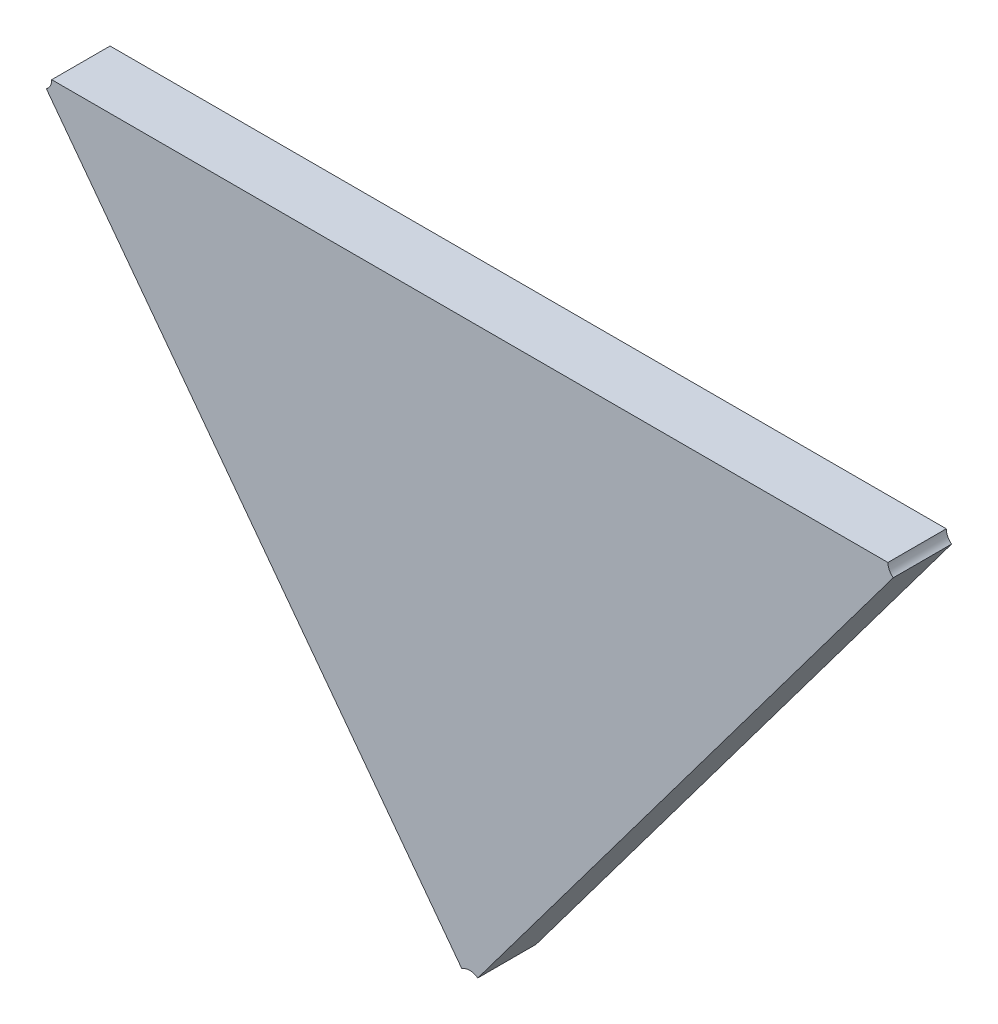
ISO-10303-21;
HEADER;
FILE_DESCRIPTION(('STEP AP214'),'2;1');
FILE_NAME('part.step','',(''),(''),'','','');
FILE_SCHEMA(('AUTOMOTIVE_DESIGN { 1 0 10303 214 1 1 1 1 }'));
ENDSEC;
DATA;
#1=APPLICATION_CONTEXT('core data for automotive mechanical design processes');
#2=APPLICATION_PROTOCOL_DEFINITION('international standard','automotive_design',2000,#1);
#3=PRODUCT_CONTEXT('',#1,'mechanical');
#4=PRODUCT('Part','Part','',(#3));
#5=PRODUCT_RELATED_PRODUCT_CATEGORY('part','',(#4));
#6=PRODUCT_DEFINITION_FORMATION('','',#4);
#7=PRODUCT_DEFINITION_CONTEXT('part definition',#1,'design');
#8=PRODUCT_DEFINITION('design','',#6,#7);
#9=PRODUCT_DEFINITION_SHAPE('','',#8);
#10=(LENGTH_UNIT() NAMED_UNIT(*) SI_UNIT(.MILLI.,.METRE.));
#11=(NAMED_UNIT(*) PLANE_ANGLE_UNIT() SI_UNIT($,.RADIAN.));
#12=(NAMED_UNIT(*) SI_UNIT($,.STERADIAN.) SOLID_ANGLE_UNIT());
#13=UNCERTAINTY_MEASURE_WITH_UNIT(LENGTH_MEASURE(1.E-05),#10,'distance_accuracy_value','');
#14=(GEOMETRIC_REPRESENTATION_CONTEXT(3) GLOBAL_UNCERTAINTY_ASSIGNED_CONTEXT((#13)) GLOBAL_UNIT_ASSIGNED_CONTEXT((#10,
#11,#12)) REPRESENTATION_CONTEXT('',''));
#15=CARTESIAN_POINT('',(0.,0.,0.));
#16=DIRECTION('',(0.,0.,1.));
#17=DIRECTION('',(1.,0.,0.));
#18=AXIS2_PLACEMENT_3D('',#15,#16,#17);
#19=CARTESIAN_POINT('',(-1.3307444469272,-1.3377475393434,0.00415));
#20=DIRECTION('',(0.,0.,1.));
#21=DIRECTION('',(1.,0.,0.));
#22=AXIS2_PLACEMENT_3D('',#19,#20,#21);
#23=PLANE('',#22);
#24=CARTESIAN_POINT('',(-1.3551454031113,-1.327552967697,0.00415));
#25=DIRECTION('',(0.,0.,-1.));
#26=DIRECTION('',(-0.599726822848916,0.800204810005254,0.));
#27=AXIS2_PLACEMENT_3D('',#24,#25,#26);
#28=CIRCLE('',#27,0.000749999999999995);
#29=CARTESIAN_POINT('',(-1.3543954031112,-1.327552967697,0.00415));
#30=VERTEX_POINT('',#29);
#31=CARTESIAN_POINT('',(-1.3546956079941,-1.3281531213045,0.00415));
#32=VERTEX_POINT('',#31);
#33=EDGE_CURVE('E11',#30,#32,#28,.T.);
#34=ORIENTED_EDGE('',*,*,#33,.T.);
#35=DIRECTION('',(0.599726822848935,-0.80020481000524,0.));
#36=VECTOR('',#35,1.);
#37=CARTESIAN_POINT('',(-1.3546956079941,-1.3281531213045,0.00415));
#38=LINE('',#37,#36);
#39=CARTESIAN_POINT('',(-1.3311942420443,-1.3595105749955,0.00415));
#40=VERTEX_POINT('',#39);
#41=EDGE_CURVE('E24',#32,#40,#38,.T.);
#42=ORIENTED_EDGE('',*,*,#41,.T.);
#43=CARTESIAN_POINT('',(-1.3307444469272,-1.360110728603,0.00415));
#44=DIRECTION('',(0.,0.,-1.));
#45=DIRECTION('',(-0.599726822848917,-0.800204810005254,0.));
#46=AXIS2_PLACEMENT_3D('',#43,#44,#45);
#47=CIRCLE('',#46,0.000750000000000013);
#48=CARTESIAN_POINT('',(-1.33029465181,-1.3595105749955,0.00415));
#49=VERTEX_POINT('',#48);
#50=EDGE_CURVE('E87',#40,#49,#47,.T.);
#51=ORIENTED_EDGE('',*,*,#50,.T.);
#52=DIRECTION('',(0.599726822848935,0.80020481000524,0.));
#53=VECTOR('',#52,1.);
#54=CARTESIAN_POINT('',(-1.33029465181,-1.3595105749955,0.00415));
#55=LINE('',#54,#53);
#56=CARTESIAN_POINT('',(-1.3067932858602,-1.3281531213045,0.00415));
#57=VERTEX_POINT('',#56);
#58=EDGE_CURVE('E112',#49,#57,#55,.T.);
#59=ORIENTED_EDGE('',*,*,#58,.T.);
#60=CARTESIAN_POINT('',(-1.3063434907431,-1.327552967697,0.00415));
#61=DIRECTION('',(0.,0.,-1.));
#62=DIRECTION('',(1.,0.,0.));
#63=AXIS2_PLACEMENT_3D('',#60,#61,#62);
#64=CIRCLE('',#63,0.000750000000000008);
#65=CARTESIAN_POINT('',(-1.3070934907431,-1.327552967697,0.00415));
#66=VERTEX_POINT('',#65);
#67=EDGE_CURVE('E110',#57,#66,#64,.T.);
#68=ORIENTED_EDGE('',*,*,#67,.T.);
#69=DIRECTION('',(-1.,0.,0.));
#70=VECTOR('',#69,1.);
#71=CARTESIAN_POINT('',(-1.3070934907431,-1.327552967697,0.00415));
#72=LINE('',#71,#70);
#73=EDGE_CURVE('E108',#66,#30,#72,.T.);
#74=ORIENTED_EDGE('',*,*,#73,.T.);
#75=EDGE_LOOP('',(#34,#42,#51,#59,#68,#74));
#76=FACE_BOUND('',#75,.T.);
#77=ADVANCED_FACE('F17',(#76),#23,.T.);
#78=CARTESIAN_POINT('',(-1.3063434907431,-1.327552967697,0.00085));
#79=DIRECTION('',(0.,1.,0.));
#80=DIRECTION('',(-1.,0.,0.));
#81=AXIS2_PLACEMENT_3D('',#78,#79,#80);
#82=PLANE('',#81);
#83=DIRECTION('',(0.,0.,1.));
#84=VECTOR('',#83,1.);
#85=CARTESIAN_POINT('',(-1.3543954031112,-1.327552967697,0.00115));
#86=LINE('',#85,#84);
#87=CARTESIAN_POINT('',(-1.3543954031112,-1.327552967697,0.00085));
#88=VERTEX_POINT('',#87);
#89=EDGE_CURVE('E105',#88,#30,#86,.T.);
#90=ORIENTED_EDGE('',*,*,#89,.T.);
#91=ORIENTED_EDGE('',*,*,#73,.F.);
#92=DIRECTION('',(0.,0.,-1.));
#93=VECTOR('',#92,1.);
#94=CARTESIAN_POINT('',(-1.3070934907431,-1.327552967697,0.00115));
#95=LINE('',#94,#93);
#96=CARTESIAN_POINT('',(-1.3070934907431,-1.327552967697,0.00085));
#97=VERTEX_POINT('',#96);
#98=EDGE_CURVE('E103',#66,#97,#95,.T.);
#99=ORIENTED_EDGE('',*,*,#98,.T.);
#100=DIRECTION('',(-1.,0.,0.));
#101=VECTOR('',#100,1.);
#102=CARTESIAN_POINT('',(-1.3063434907431,-1.327552967697,0.00085));
#103=LINE('',#102,#101);
#104=EDGE_CURVE('E100',#97,#88,#103,.T.);
#105=ORIENTED_EDGE('',*,*,#104,.T.);
#106=EDGE_LOOP('',(#90,#91,#99,#105));
#107=FACE_BOUND('',#106,.T.);
#108=ADVANCED_FACE('F127',(#107),#82,.T.);
#109=CARTESIAN_POINT('',(-1.3307444469272,-1.360110728603,0.00085));
#110=DIRECTION('',(0.800204810005241,-0.599726822848934,0.));
#111=DIRECTION('',(0.599726822848934,0.800204810005241,0.));
#112=AXIS2_PLACEMENT_3D('',#109,#110,#111);
#113=PLANE('',#112);
#114=DIRECTION('',(0.,0.,-1.));
#115=VECTOR('',#114,1.);
#116=CARTESIAN_POINT('',(-1.33029465181,-1.3595105749955,0.00115));
#117=LINE('',#116,#115);
#118=CARTESIAN_POINT('',(-1.33029465181,-1.3595105749955,0.00085));
#119=VERTEX_POINT('',#118);
#120=EDGE_CURVE('E98',#49,#119,#117,.T.);
#121=ORIENTED_EDGE('',*,*,#120,.T.);
#122=DIRECTION('',(0.599726822848934,0.800204810005241,0.));
#123=VECTOR('',#122,1.);
#124=CARTESIAN_POINT('',(-1.3307444469272,-1.360110728603,0.00085));
#125=LINE('',#124,#123);
#126=CARTESIAN_POINT('',(-1.3067932858602,-1.3281531213045,0.00085));
#127=VERTEX_POINT('',#126);
#128=EDGE_CURVE('E73',#119,#127,#125,.T.);
#129=ORIENTED_EDGE('',*,*,#128,.T.);
#130=DIRECTION('',(0.,0.,1.));
#131=VECTOR('',#130,1.);
#132=CARTESIAN_POINT('',(-1.3067932858602,-1.3281531213045,0.00115));
#133=LINE('',#132,#131);
#134=EDGE_CURVE('E94',#127,#57,#133,.T.);
#135=ORIENTED_EDGE('',*,*,#134,.T.);
#136=ORIENTED_EDGE('',*,*,#58,.F.);
#137=EDGE_LOOP('',(#121,#129,#135,#136));
#138=FACE_BOUND('',#137,.T.);
#139=ADVANCED_FACE('F125',(#138),#113,.T.);
#140=CARTESIAN_POINT('',(-1.322611951906,-1.3397638650791,0.00085));
#141=DIRECTION('',(0.,0.,1.));
#142=DIRECTION('',(1.,0.,0.));
#143=AXIS2_PLACEMENT_3D('',#140,#141,#142);
#144=PLANE('',#143);
#145=CARTESIAN_POINT('',(-1.3551454031113,-1.327552967697,0.00085));
#146=DIRECTION('',(0.,0.,1.));
#147=DIRECTION('',(-1.,0.,0.));
#148=AXIS2_PLACEMENT_3D('',#145,#146,#147);
#149=CIRCLE('',#148,0.000749999999999995);
#150=CARTESIAN_POINT('',(-1.3546956079941,-1.3281531213045,0.00085));
#151=VERTEX_POINT('',#150);
#152=EDGE_CURVE('E92',#151,#88,#149,.T.);
#153=ORIENTED_EDGE('',*,*,#152,.T.);
#154=ORIENTED_EDGE('',*,*,#104,.F.);
#155=CARTESIAN_POINT('',(-1.3063434907431,-1.327552967697,0.00085));
#156=DIRECTION('',(0.,0.,1.));
#157=DIRECTION('',(-1.,0.,0.));
#158=AXIS2_PLACEMENT_3D('',#155,#156,#157);
#159=CIRCLE('',#158,0.000750000000000008);
#160=EDGE_CURVE('E77',#97,#127,#159,.T.);
#161=ORIENTED_EDGE('',*,*,#160,.T.);
#162=ORIENTED_EDGE('',*,*,#128,.F.);
#163=CARTESIAN_POINT('',(-1.3307444469272,-1.360110728603,0.00085));
#164=DIRECTION('',(0.,0.,1.));
#165=DIRECTION('',(-1.,0.,0.));
#166=AXIS2_PLACEMENT_3D('',#163,#164,#165);
#167=CIRCLE('',#166,0.000750000000000013);
#168=CARTESIAN_POINT('',(-1.3311942420443,-1.3595105749955,0.00085));
#169=VERTEX_POINT('',#168);
#170=EDGE_CURVE('E66',#119,#169,#167,.T.);
#171=ORIENTED_EDGE('',*,*,#170,.T.);
#172=DIRECTION('',(-0.599726822848934,0.800204810005241,0.));
#173=VECTOR('',#172,1.);
#174=CARTESIAN_POINT('',(-1.3307444469272,-1.360110728603,0.00085));
#175=LINE('',#174,#173);
#176=EDGE_CURVE('E70',#169,#151,#175,.T.);
#177=ORIENTED_EDGE('',*,*,#176,.T.);
#178=EDGE_LOOP('',(#153,#154,#161,#162,#171,#177));
#179=FACE_BOUND('',#178,.T.);
#180=ADVANCED_FACE('F69',(#179),#144,.F.);
#181=CARTESIAN_POINT('',(-1.3307444469272,-1.360110728603,0.00085));
#182=DIRECTION('',(0.800204810005241,0.599726822848934,0.));
#183=DIRECTION('',(-0.599726822848934,0.800204810005241,0.));
#184=AXIS2_PLACEMENT_3D('',#181,#182,#183);
#185=PLANE('',#184);
#186=DIRECTION('',(0.,0.,1.));
#187=VECTOR('',#186,1.);
#188=CARTESIAN_POINT('',(-1.3546956079941,-1.3281531213045,0.00115));
#189=LINE('',#188,#187);
#190=EDGE_CURVE('E83',#151,#32,#189,.T.);
#191=ORIENTED_EDGE('',*,*,#190,.F.);
#192=ORIENTED_EDGE('',*,*,#176,.F.);
#193=DIRECTION('',(0.,0.,1.));
#194=VECTOR('',#193,1.);
#195=CARTESIAN_POINT('',(-1.3311942420443,-1.3595105749955,0.00115));
#196=LINE('',#195,#194);
#197=EDGE_CURVE('E82',#169,#40,#196,.T.);
#198=ORIENTED_EDGE('',*,*,#197,.T.);
#199=ORIENTED_EDGE('',*,*,#41,.F.);
#200=EDGE_LOOP('',(#191,#192,#198,#199));
#201=FACE_BOUND('',#200,.T.);
#202=ADVANCED_FACE('F81',(#201),#185,.F.);
#203=CARTESIAN_POINT('',(-1.3063434907431,-1.327552967697,0.00115));
#204=DIRECTION('',(0.,0.,1.));
#205=DIRECTION('',(-1.,0.,0.));
#206=AXIS2_PLACEMENT_3D('',#203,#204,#205);
#207=CYLINDRICAL_SURFACE('',#206,0.000750000000000008);
#208=ORIENTED_EDGE('',*,*,#98,.F.);
#209=ORIENTED_EDGE('',*,*,#67,.F.);
#210=ORIENTED_EDGE('',*,*,#134,.F.);
#211=ORIENTED_EDGE('',*,*,#160,.F.);
#212=EDGE_LOOP('',(#208,#209,#210,#211));
#213=FACE_BOUND('',#212,.T.);
#214=ADVANCED_FACE('F122',(#213),#207,.F.);
#215=CARTESIAN_POINT('',(-1.3307444469272,-1.360110728603,0.00115));
#216=DIRECTION('',(0.,0.,1.));
#217=DIRECTION('',(-1.,0.,0.));
#218=AXIS2_PLACEMENT_3D('',#215,#216,#217);
#219=CYLINDRICAL_SURFACE('',#218,0.000750000000000013);
#220=ORIENTED_EDGE('',*,*,#120,.F.);
#221=ORIENTED_EDGE('',*,*,#50,.F.);
#222=ORIENTED_EDGE('',*,*,#197,.F.);
#223=ORIENTED_EDGE('',*,*,#170,.F.);
#224=EDGE_LOOP('',(#220,#221,#222,#223));
#225=FACE_BOUND('',#224,.T.);
#226=ADVANCED_FACE('F86',(#225),#219,.F.);
#227=CARTESIAN_POINT('',(-1.3551454031113,-1.327552967697,0.00115));
#228=DIRECTION('',(0.,0.,1.));
#229=DIRECTION('',(-1.,0.,0.));
#230=AXIS2_PLACEMENT_3D('',#227,#228,#229);
#231=CYLINDRICAL_SURFACE('',#230,0.000749999999999995);
#232=ORIENTED_EDGE('',*,*,#89,.F.);
#233=ORIENTED_EDGE('',*,*,#152,.F.);
#234=ORIENTED_EDGE('',*,*,#190,.T.);
#235=ORIENTED_EDGE('',*,*,#33,.F.);
#236=EDGE_LOOP('',(#232,#233,#234,#235));
#237=FACE_BOUND('',#236,.T.);
#238=ADVANCED_FACE('F115',(#237),#231,.F.);
#239=CLOSED_SHELL('',(#77,#108,#139,#180,#202,#214,#226,#238));
#240=MANIFOLD_SOLID_BREP('B1',#239);
#241=ADVANCED_BREP_SHAPE_REPRESENTATION('',(#18,#240),#14);
#242=SHAPE_DEFINITION_REPRESENTATION(#9,#241);
ENDSEC;
END-ISO-10303-21;
